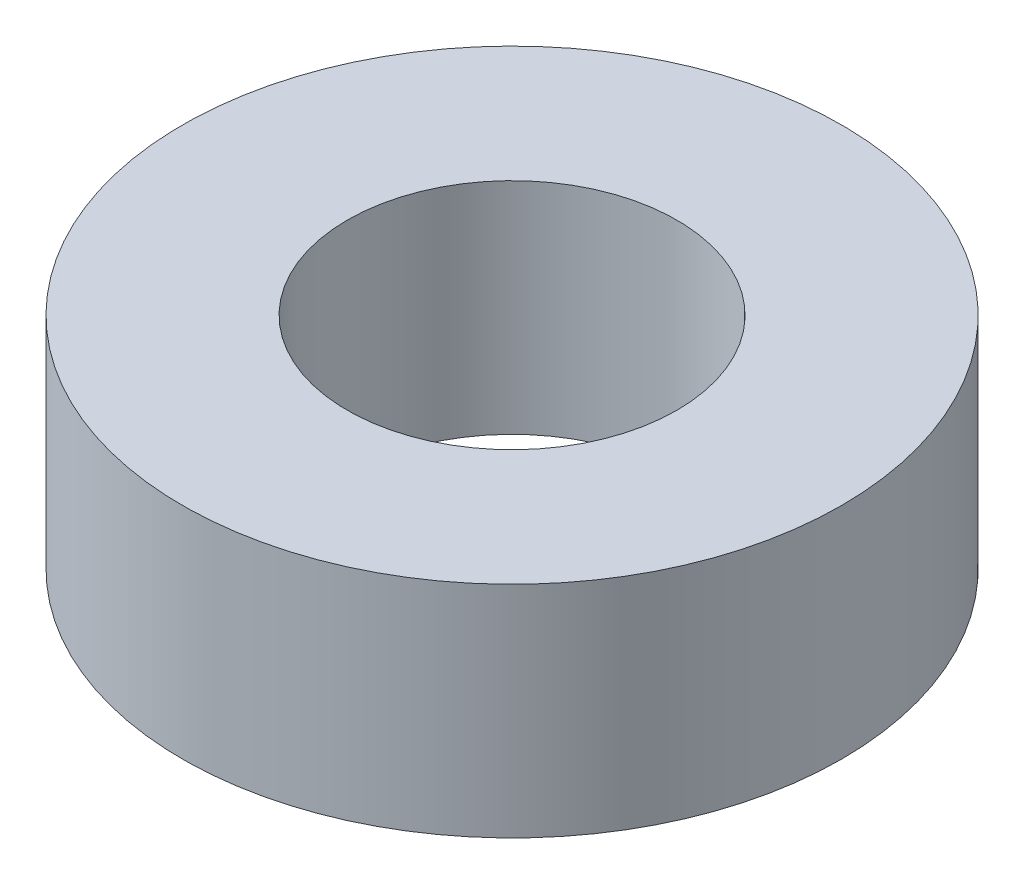
ISO-10303-21;
HEADER;
FILE_DESCRIPTION(('STEP AP214'),'2;1');
FILE_NAME('part.step','',(''),(''),'','','');
FILE_SCHEMA(('AUTOMOTIVE_DESIGN { 1 0 10303 214 1 1 1 1 }'));
ENDSEC;
DATA;
#1=APPLICATION_CONTEXT('core data for automotive mechanical design processes');
#2=APPLICATION_PROTOCOL_DEFINITION('international standard','automotive_design',2000,#1);
#3=PRODUCT_CONTEXT('',#1,'mechanical');
#4=PRODUCT('Part','Part','',(#3));
#5=PRODUCT_RELATED_PRODUCT_CATEGORY('part','',(#4));
#6=PRODUCT_DEFINITION_FORMATION('','',#4);
#7=PRODUCT_DEFINITION_CONTEXT('part definition',#1,'design');
#8=PRODUCT_DEFINITION('design','',#6,#7);
#9=PRODUCT_DEFINITION_SHAPE('','',#8);
#10=(LENGTH_UNIT() NAMED_UNIT(*) SI_UNIT(.MILLI.,.METRE.));
#11=(NAMED_UNIT(*) PLANE_ANGLE_UNIT() SI_UNIT($,.RADIAN.));
#12=(NAMED_UNIT(*) SI_UNIT($,.STERADIAN.) SOLID_ANGLE_UNIT());
#13=UNCERTAINTY_MEASURE_WITH_UNIT(LENGTH_MEASURE(1.E-05),#10,'distance_accuracy_value','');
#14=(GEOMETRIC_REPRESENTATION_CONTEXT(3) GLOBAL_UNCERTAINTY_ASSIGNED_CONTEXT((#13)) GLOBAL_UNIT_ASSIGNED_CONTEXT((#10,
#11,#12)) REPRESENTATION_CONTEXT('',''));
#15=CARTESIAN_POINT('',(0.,0.,0.));
#16=DIRECTION('',(0.,0.,1.));
#17=DIRECTION('',(1.,0.,0.));
#18=AXIS2_PLACEMENT_3D('',#15,#16,#17);
#19=CARTESIAN_POINT('',(1328.7375,-19.05,-241.3));
#20=DIRECTION('',(0.,1.,0.));
#21=DIRECTION('',(0.,0.,1.));
#22=AXIS2_PLACEMENT_3D('',#19,#20,#21);
#23=CYLINDRICAL_SURFACE('',#22,9.525);
#24=CARTESIAN_POINT('',(1328.7375,-19.05,-241.3));
#25=DIRECTION('',(0.,-1.,0.));
#26=DIRECTION('',(1.,0.,0.));
#27=AXIS2_PLACEMENT_3D('',#24,#25,#26);
#28=CIRCLE('',#27,9.525);
#29=CARTESIAN_POINT('',(1338.2625,-19.05,-241.3));
#30=VERTEX_POINT('',#29);
#31=EDGE_CURVE('E22',#30,#30,#28,.T.);
#32=ORIENTED_EDGE('',*,*,#31,.T.);
#33=EDGE_LOOP('',(#32));
#34=FACE_BOUND('',#33,.T.);
#35=CARTESIAN_POINT('',(1328.7375,-6.35,-241.3));
#36=DIRECTION('',(0.,-1.,0.));
#37=DIRECTION('',(1.,0.,0.));
#38=AXIS2_PLACEMENT_3D('',#35,#36,#37);
#39=CIRCLE('',#38,9.525);
#40=CARTESIAN_POINT('',(1338.2625,-6.35,-241.3));
#41=VERTEX_POINT('',#40);
#42=EDGE_CURVE('E33',#41,#41,#39,.T.);
#43=ORIENTED_EDGE('',*,*,#42,.F.);
#44=EDGE_LOOP('',(#43));
#45=FACE_BOUND('',#44,.T.);
#46=ADVANCED_FACE('F14',(#34,#45),#23,.F.);
#47=CARTESIAN_POINT('',(1328.7375,-19.05,-241.3));
#48=DIRECTION('',(0.,1.,0.));
#49=DIRECTION('',(0.,0.,1.));
#50=AXIS2_PLACEMENT_3D('',#47,#48,#49);
#51=CYLINDRICAL_SURFACE('',#50,19.05);
#52=CARTESIAN_POINT('',(1328.7375,-19.05,-241.3));
#53=DIRECTION('',(0.,-1.,0.));
#54=DIRECTION('',(1.,0.,0.));
#55=AXIS2_PLACEMENT_3D('',#52,#53,#54);
#56=CIRCLE('',#55,19.05);
#57=CARTESIAN_POINT('',(1347.7875,-19.05,-241.3));
#58=VERTEX_POINT('',#57);
#59=EDGE_CURVE('E10',#58,#58,#56,.T.);
#60=ORIENTED_EDGE('',*,*,#59,.F.);
#61=EDGE_LOOP('',(#60));
#62=FACE_BOUND('',#61,.T.);
#63=CARTESIAN_POINT('',(1328.7375,-6.35,-241.3));
#64=DIRECTION('',(0.,-1.,0.));
#65=DIRECTION('',(1.,0.,0.));
#66=AXIS2_PLACEMENT_3D('',#63,#64,#65);
#67=CIRCLE('',#66,19.05);
#68=CARTESIAN_POINT('',(1347.7875,-6.35,-241.3));
#69=VERTEX_POINT('',#68);
#70=EDGE_CURVE('E17',#69,#69,#67,.T.);
#71=ORIENTED_EDGE('',*,*,#70,.T.);
#72=EDGE_LOOP('',(#71));
#73=FACE_BOUND('',#72,.T.);
#74=ADVANCED_FACE('F43',(#62,#73),#51,.T.);
#75=CARTESIAN_POINT('',(1328.7375,-19.05,-152.4));
#76=DIRECTION('',(0.,-1.,0.));
#77=DIRECTION('',(1.,0.,0.));
#78=AXIS2_PLACEMENT_3D('',#75,#76,#77);
#79=PLANE('',#78);
#80=ORIENTED_EDGE('',*,*,#31,.F.);
#81=EDGE_LOOP('',(#80));
#82=FACE_BOUND('',#81,.T.);
#83=ORIENTED_EDGE('',*,*,#59,.T.);
#84=EDGE_LOOP('',(#83));
#85=FACE_BOUND('',#84,.T.);
#86=ADVANCED_FACE('F47',(#82,#85),#79,.T.);
#87=CARTESIAN_POINT('',(1328.7375,-6.35,-152.4));
#88=DIRECTION('',(0.,-1.,0.));
#89=DIRECTION('',(1.,0.,0.));
#90=AXIS2_PLACEMENT_3D('',#87,#88,#89);
#91=PLANE('',#90);
#92=ORIENTED_EDGE('',*,*,#42,.T.);
#93=EDGE_LOOP('',(#92));
#94=FACE_BOUND('',#93,.T.);
#95=ORIENTED_EDGE('',*,*,#70,.F.);
#96=EDGE_LOOP('',(#95));
#97=FACE_BOUND('',#96,.T.);
#98=ADVANCED_FACE('F45',(#94,#97),#91,.F.);
#99=CLOSED_SHELL('',(#46,#74,#86,#98));
#100=MANIFOLD_SOLID_BREP('B1',#99);
#101=ADVANCED_BREP_SHAPE_REPRESENTATION('',(#18,#100),#14);
#102=SHAPE_DEFINITION_REPRESENTATION(#9,#101);
ENDSEC;
END-ISO-10303-21;
